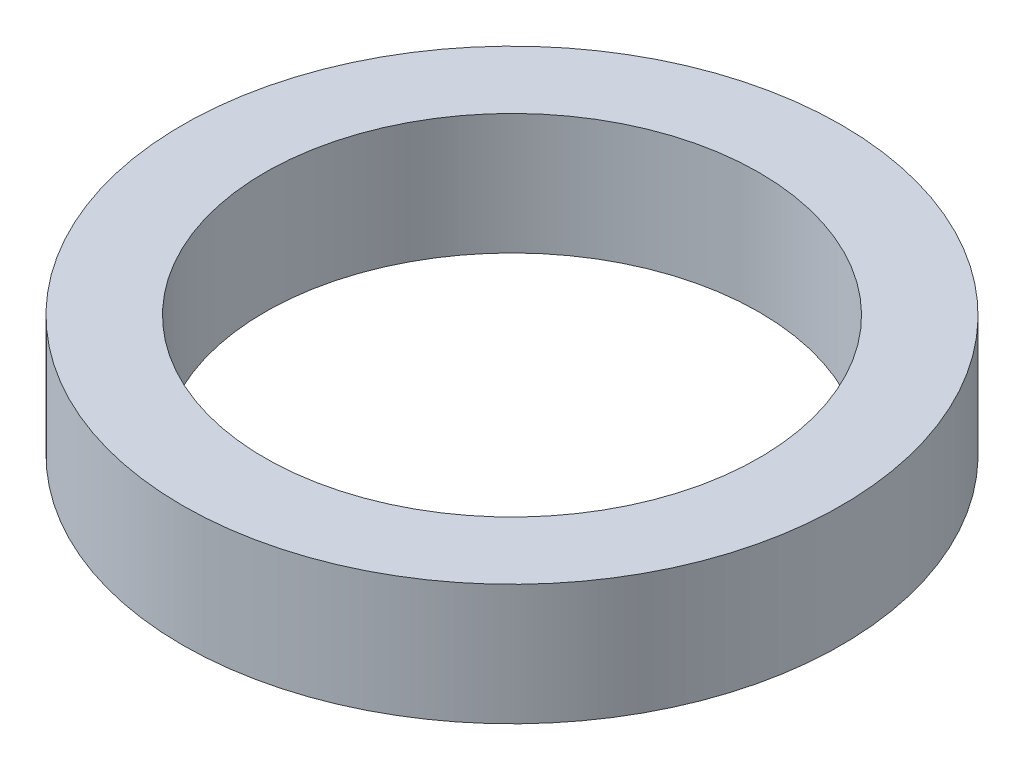
ISO-10303-21;
HEADER;
FILE_DESCRIPTION(('STEP AP214'),'2;1');
FILE_NAME('part.step','',(''),(''),'','','');
FILE_SCHEMA(('AUTOMOTIVE_DESIGN { 1 0 10303 214 1 1 1 1 }'));
ENDSEC;
DATA;
#1=APPLICATION_CONTEXT('core data for automotive mechanical design processes');
#2=APPLICATION_PROTOCOL_DEFINITION('international standard','automotive_design',2000,#1);
#3=PRODUCT_CONTEXT('',#1,'mechanical');
#4=PRODUCT('Part','Part','',(#3));
#5=PRODUCT_RELATED_PRODUCT_CATEGORY('part','',(#4));
#6=PRODUCT_DEFINITION_FORMATION('','',#4);
#7=PRODUCT_DEFINITION_CONTEXT('part definition',#1,'design');
#8=PRODUCT_DEFINITION('design','',#6,#7);
#9=PRODUCT_DEFINITION_SHAPE('','',#8);
#10=(LENGTH_UNIT() NAMED_UNIT(*) SI_UNIT(.MILLI.,.METRE.));
#11=(NAMED_UNIT(*) PLANE_ANGLE_UNIT() SI_UNIT($,.RADIAN.));
#12=(NAMED_UNIT(*) SI_UNIT($,.STERADIAN.) SOLID_ANGLE_UNIT());
#13=UNCERTAINTY_MEASURE_WITH_UNIT(LENGTH_MEASURE(1.E-05),#10,'distance_accuracy_value','');
#14=(GEOMETRIC_REPRESENTATION_CONTEXT(3) GLOBAL_UNCERTAINTY_ASSIGNED_CONTEXT((#13)) GLOBAL_UNIT_ASSIGNED_CONTEXT((#10,
#11,#12)) REPRESENTATION_CONTEXT('',''));
#15=CARTESIAN_POINT('',(0.,0.,0.));
#16=DIRECTION('',(0.,0.,1.));
#17=DIRECTION('',(1.,0.,0.));
#18=AXIS2_PLACEMENT_3D('',#15,#16,#17);
#19=CARTESIAN_POINT('',(0.,0.,0.));
#20=DIRECTION('',(0.,1.,0.));
#21=DIRECTION('',(0.,0.,1.));
#22=AXIS2_PLACEMENT_3D('',#19,#20,#21);
#23=PLANE('',#22);
#24=CARTESIAN_POINT('',(0.,0.,0.));
#25=DIRECTION('',(0.,-1.,0.));
#26=DIRECTION('',(0.,0.,-1.));
#27=AXIS2_PLACEMENT_3D('',#24,#25,#26);
#28=CIRCLE('',#27,45.);
#29=CARTESIAN_POINT('',(0.,0.,-45.));
#30=VERTEX_POINT('',#29);
#31=EDGE_CURVE('E28',#30,#30,#28,.F.);
#32=ORIENTED_EDGE('',*,*,#31,.T.);
#33=EDGE_LOOP('',(#32));
#34=FACE_BOUND('',#33,.T.);
#35=CARTESIAN_POINT('',(0.,0.,0.));
#36=DIRECTION('',(0.,-1.,0.));
#37=DIRECTION('',(0.,0.,-1.));
#38=AXIS2_PLACEMENT_3D('',#35,#36,#37);
#39=CIRCLE('',#38,60.);
#40=CARTESIAN_POINT('',(0.,0.,-60.));
#41=VERTEX_POINT('',#40);
#42=EDGE_CURVE('E19',#41,#41,#39,.F.);
#43=ORIENTED_EDGE('',*,*,#42,.F.);
#44=EDGE_LOOP('',(#43));
#45=FACE_BOUND('',#44,.T.);
#46=ADVANCED_FACE('F16',(#34,#45),#23,.F.);
#47=CARTESIAN_POINT('',(0.,22.,0.));
#48=DIRECTION('',(0.,-1.,0.));
#49=DIRECTION('',(0.,0.,-1.));
#50=AXIS2_PLACEMENT_3D('',#47,#48,#49);
#51=CYLINDRICAL_SURFACE('',#50,60.);
#52=ORIENTED_EDGE('',*,*,#42,.T.);
#53=EDGE_LOOP('',(#52));
#54=FACE_BOUND('',#53,.T.);
#55=CARTESIAN_POINT('',(0.,22.,0.));
#56=DIRECTION('',(0.,-1.,0.));
#57=DIRECTION('',(0.,0.,-1.));
#58=AXIS2_PLACEMENT_3D('',#55,#56,#57);
#59=CIRCLE('',#58,60.);
#60=CARTESIAN_POINT('',(0.,22.,-60.));
#61=VERTEX_POINT('',#60);
#62=EDGE_CURVE('E23',#61,#61,#59,.F.);
#63=ORIENTED_EDGE('',*,*,#62,.F.);
#64=EDGE_LOOP('',(#63));
#65=FACE_BOUND('',#64,.T.);
#66=ADVANCED_FACE('F36',(#54,#65),#51,.T.);
#67=CARTESIAN_POINT('',(0.,22.,0.));
#68=DIRECTION('',(0.,-1.,0.));
#69=DIRECTION('',(0.,0.,-1.));
#70=AXIS2_PLACEMENT_3D('',#67,#68,#69);
#71=CYLINDRICAL_SURFACE('',#70,45.);
#72=CARTESIAN_POINT('',(0.,22.,0.));
#73=DIRECTION('',(0.,-1.,0.));
#74=DIRECTION('',(0.,0.,-1.));
#75=AXIS2_PLACEMENT_3D('',#72,#73,#74);
#76=CIRCLE('',#75,45.);
#77=CARTESIAN_POINT('',(0.,22.,-45.));
#78=VERTEX_POINT('',#77);
#79=EDGE_CURVE('E10',#78,#78,#76,.T.);
#80=ORIENTED_EDGE('',*,*,#79,.F.);
#81=EDGE_LOOP('',(#80));
#82=FACE_BOUND('',#81,.T.);
#83=ORIENTED_EDGE('',*,*,#31,.F.);
#84=EDGE_LOOP('',(#83));
#85=FACE_BOUND('',#84,.T.);
#86=ADVANCED_FACE('F43',(#82,#85),#71,.F.);
#87=CARTESIAN_POINT('',(0.,22.,0.));
#88=DIRECTION('',(0.,1.,0.));
#89=DIRECTION('',(0.,0.,1.));
#90=AXIS2_PLACEMENT_3D('',#87,#88,#89);
#91=PLANE('',#90);
#92=ORIENTED_EDGE('',*,*,#79,.T.);
#93=EDGE_LOOP('',(#92));
#94=FACE_BOUND('',#93,.T.);
#95=ORIENTED_EDGE('',*,*,#62,.T.);
#96=EDGE_LOOP('',(#95));
#97=FACE_BOUND('',#96,.T.);
#98=ADVANCED_FACE('F44',(#94,#97),#91,.T.);
#99=CLOSED_SHELL('',(#46,#66,#86,#98));
#100=MANIFOLD_SOLID_BREP('B1',#99);
#101=ADVANCED_BREP_SHAPE_REPRESENTATION('',(#18,#100),#14);
#102=SHAPE_DEFINITION_REPRESENTATION(#9,#101);
ENDSEC;
END-ISO-10303-21;
